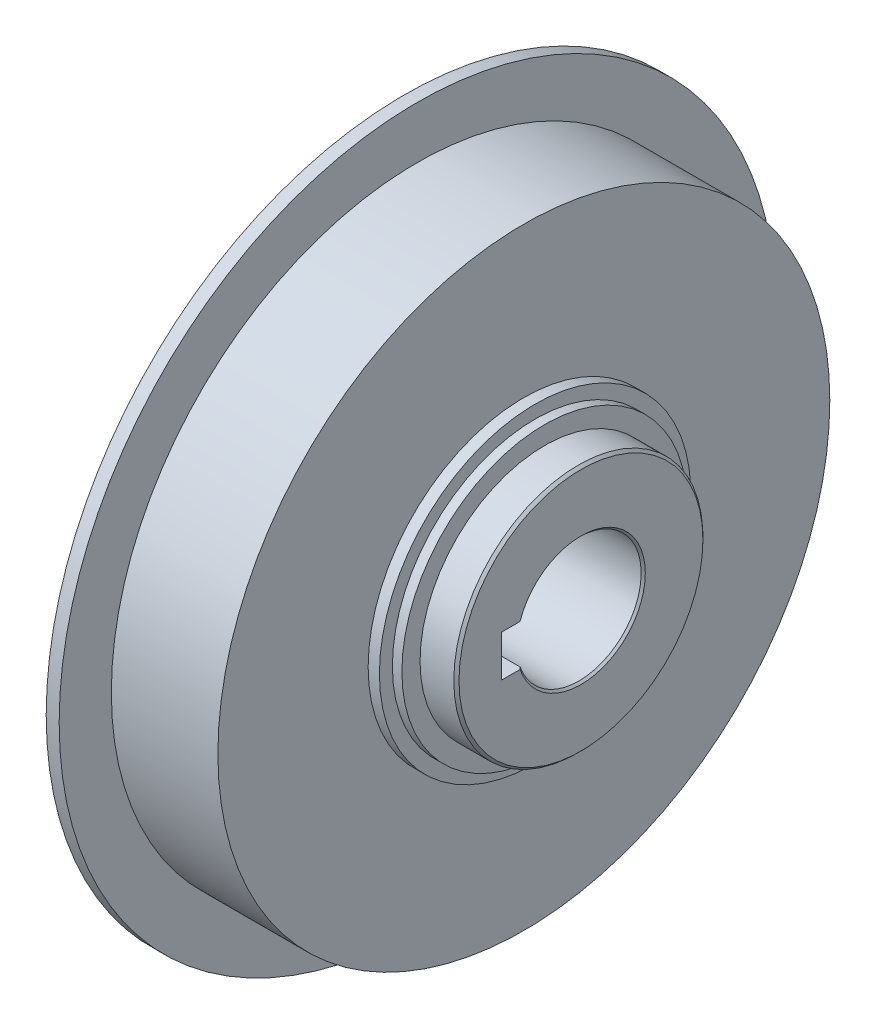
ISO-10303-21;
HEADER;
FILE_DESCRIPTION(('STEP AP214'),'2;1');
FILE_NAME('part.step','',(''),(''),'','','');
FILE_SCHEMA(('AUTOMOTIVE_DESIGN { 1 0 10303 214 1 1 1 1 }'));
ENDSEC;
DATA;
#1=APPLICATION_CONTEXT('core data for automotive mechanical design processes');
#2=APPLICATION_PROTOCOL_DEFINITION('international standard','automotive_design',2000,#1);
#3=PRODUCT_CONTEXT('',#1,'mechanical');
#4=PRODUCT('Part','Part','',(#3));
#5=PRODUCT_RELATED_PRODUCT_CATEGORY('part','',(#4));
#6=PRODUCT_DEFINITION_FORMATION('','',#4);
#7=PRODUCT_DEFINITION_CONTEXT('part definition',#1,'design');
#8=PRODUCT_DEFINITION('design','',#6,#7);
#9=PRODUCT_DEFINITION_SHAPE('','',#8);
#10=(LENGTH_UNIT() NAMED_UNIT(*) SI_UNIT(.MILLI.,.METRE.));
#11=(NAMED_UNIT(*) PLANE_ANGLE_UNIT() SI_UNIT($,.RADIAN.));
#12=(NAMED_UNIT(*) SI_UNIT($,.STERADIAN.) SOLID_ANGLE_UNIT());
#13=UNCERTAINTY_MEASURE_WITH_UNIT(LENGTH_MEASURE(1.E-05),#10,'distance_accuracy_value','');
#14=(GEOMETRIC_REPRESENTATION_CONTEXT(3) GLOBAL_UNCERTAINTY_ASSIGNED_CONTEXT((#13)) GLOBAL_UNIT_ASSIGNED_CONTEXT((#10,
#11,#12)) REPRESENTATION_CONTEXT('',''));
#15=CARTESIAN_POINT('',(0.,0.,0.));
#16=DIRECTION('',(0.,0.,1.));
#17=DIRECTION('',(1.,0.,0.));
#18=AXIS2_PLACEMENT_3D('',#15,#16,#17);
#19=CARTESIAN_POINT('',(83.1,0.,0.));
#20=DIRECTION('',(1.,0.,0.));
#21=DIRECTION('',(0.,0.,-1.00000000000001));
#22=AXIS2_PLACEMENT_3D('',#19,#20,#21);
#23=CONICAL_SURFACE('',#22,12.4,0.78539816339744);
#24=CARTESIAN_POINT('',(82.7,0.,0.));
#25=DIRECTION('',(-1.,0.,0.));
#26=DIRECTION('',(0.,0.,1.00000000000001));
#27=AXIS2_PLACEMENT_3D('',#24,#25,#26);
#28=CIRCLE('',#27,12.);
#29=CARTESIAN_POINT('',(82.7,4.,11.3137084989848));
#30=VERTEX_POINT('',#29);
#31=CARTESIAN_POINT('',(82.7,-4.,11.3137084989848));
#32=VERTEX_POINT('',#31);
#33=EDGE_CURVE('E87',#30,#32,#28,.T.);
#34=ORIENTED_EDGE('',*,*,#33,.T.);
#35=CARTESIAN_POINT('',(83.1,-4.,11.7371206008971));
#36=CARTESIAN_POINT('',(83.0332637530497,-4.,11.6666176506963));
#37=CARTESIAN_POINT('',(82.9665622963739,-4.,11.5960818339106));
#38=CARTESIAN_POINT('',(82.83322896304,-4.,11.454944466607));
#39=CARTESIAN_POINT('',(82.7665970863825,-4.,11.3843429160886));
#40=CARTESIAN_POINT('',(82.7,-4.,11.3137084989848));
#41=B_SPLINE_CURVE_WITH_KNOTS('',3,(#35,#36,#37,#38,#39,#40),.UNSPECIFIED.,.F.,.F.,(4,2,4),(0.,
0.291237827128785,0.582475656578423),.UNSPECIFIED.);
#42=CARTESIAN_POINT('',(83.1,-4.,11.737120600897));
#43=VERTEX_POINT('',#42);
#44=EDGE_CURVE('E82',#43,#32,#41,.T.);
#45=ORIENTED_EDGE('',*,*,#44,.F.);
#46=CARTESIAN_POINT('',(83.1,0.,0.));
#47=DIRECTION('',(1.,0.,0.));
#48=DIRECTION('',(0.,0.,-1.00000000000001));
#49=AXIS2_PLACEMENT_3D('',#46,#47,#48);
#50=CIRCLE('',#49,12.4);
#51=CARTESIAN_POINT('',(83.1,4.,11.7371206008971));
#52=VERTEX_POINT('',#51);
#53=EDGE_CURVE('E80',#52,#43,#50,.F.);
#54=ORIENTED_EDGE('',*,*,#53,.F.);
#55=CARTESIAN_POINT('',(82.7,4.,11.3137084989848));
#56=CARTESIAN_POINT('',(82.7665970863825,4.,11.3843429160886));
#57=CARTESIAN_POINT('',(82.83322896304,4.,11.454944466607));
#58=CARTESIAN_POINT('',(82.9665622963739,4.,11.5960818339106));
#59=CARTESIAN_POINT('',(83.0332637530497,4.,11.6666176506963));
#60=CARTESIAN_POINT('',(83.1,4.,11.7371206008971));
#61=B_SPLINE_CURVE_WITH_KNOTS('',3,(#55,#56,#57,#58,#59,#60),.UNSPECIFIED.,.F.,.F.,(4,2,4),(0.,
0.291237829449643,0.58247565657843),.UNSPECIFIED.);
#62=EDGE_CURVE('E28',#30,#52,#61,.T.);
#63=ORIENTED_EDGE('',*,*,#62,.F.);
#64=EDGE_LOOP('',(#34,#45,#54,#63));
#65=FACE_BOUND('',#64,.T.);
#66=ADVANCED_FACE('F24',(#65),#23,.F.);
#67=CARTESIAN_POINT('',(60.8,0.,0.));
#68=DIRECTION('',(-1.,0.,0.));
#69=DIRECTION('',(0.,0.,1.00000000000001));
#70=AXIS2_PLACEMENT_3D('',#67,#68,#69);
#71=CYLINDRICAL_SURFACE('',#70,12.);
#72=ORIENTED_EDGE('',*,*,#33,.F.);
#73=DIRECTION('',(1.,0.,0.));
#74=VECTOR('',#73,1.);
#75=CARTESIAN_POINT('',(60.8,4.,11.3137084989848));
#76=LINE('',#75,#74);
#77=CARTESIAN_POINT('',(38.9,4.,11.3137084989848));
#78=VERTEX_POINT('',#77);
#79=EDGE_CURVE('E95',#78,#30,#76,.T.);
#80=ORIENTED_EDGE('',*,*,#79,.F.);
#81=CARTESIAN_POINT('',(38.9,0.,0.));
#82=DIRECTION('',(-1.,0.,0.));
#83=DIRECTION('',(0.,0.,1.00000000000001));
#84=AXIS2_PLACEMENT_3D('',#81,#82,#83);
#85=CIRCLE('',#84,12.);
#86=CARTESIAN_POINT('',(38.9,-4.,11.3137084989848));
#87=VERTEX_POINT('',#86);
#88=EDGE_CURVE('E101',#78,#87,#85,.T.);
#89=ORIENTED_EDGE('',*,*,#88,.T.);
#90=DIRECTION('',(1.,0.,0.));
#91=VECTOR('',#90,1.);
#92=CARTESIAN_POINT('',(60.8,-4.,11.3137084989848));
#93=LINE('',#92,#91);
#94=EDGE_CURVE('E86',#32,#87,#93,.F.);
#95=ORIENTED_EDGE('',*,*,#94,.F.);
#96=EDGE_LOOP('',(#72,#80,#89,#95));
#97=FACE_BOUND('',#96,.T.);
#98=ADVANCED_FACE('F315',(#97),#71,.F.);
#99=CARTESIAN_POINT('',(83.1,0.,17.9500000000001));
#100=DIRECTION('',(1.,0.,0.));
#101=DIRECTION('',(0.,0.,-1.00000000000001));
#102=AXIS2_PLACEMENT_3D('',#99,#100,#101);
#103=PLANE('',#102);
#104=DIRECTION('',(0.,0.,-1.00000000000001));
#105=VECTOR('',#104,1.);
#106=CARTESIAN_POINT('',(83.1,4.,7.65000000000005));
#107=LINE('',#106,#105);
#108=CARTESIAN_POINT('',(83.1,4.,15.3000000000001));
#109=VERTEX_POINT('',#108);
#110=EDGE_CURVE('E92',#52,#109,#107,.F.);
#111=ORIENTED_EDGE('',*,*,#110,.F.);
#112=ORIENTED_EDGE('',*,*,#53,.T.);
#113=DIRECTION('',(0.,0.,1.00000000000001));
#114=VECTOR('',#113,1.);
#115=CARTESIAN_POINT('',(83.1,-4.,7.65000000000005));
#116=LINE('',#115,#114);
#117=CARTESIAN_POINT('',(83.1,-4.,15.3000000000001));
#118=VERTEX_POINT('',#117);
#119=EDGE_CURVE('E117',#118,#43,#116,.F.);
#120=ORIENTED_EDGE('',*,*,#119,.F.);
#121=DIRECTION('',(0.,1.00000000000001,0.));
#122=VECTOR('',#121,1.);
#123=CARTESIAN_POINT('',(83.1,0.,15.3000000000001));
#124=LINE('',#123,#122);
#125=EDGE_CURVE('E99',#118,#109,#124,.T.);
#126=ORIENTED_EDGE('',*,*,#125,.T.);
#127=EDGE_LOOP('',(#111,#112,#120,#126));
#128=FACE_BOUND('',#127,.T.);
#129=CARTESIAN_POINT('',(83.1,0.,0.));
#130=DIRECTION('',(-1.,0.,0.));
#131=DIRECTION('',(0.,0.,1.00000000000001));
#132=AXIS2_PLACEMENT_3D('',#129,#130,#131);
#133=CIRCLE('',#132,23.5);
#134=CARTESIAN_POINT('',(83.1,0.,23.5000000000001));
#135=VERTEX_POINT('',#134);
#136=EDGE_CURVE('E156',#135,#135,#133,.T.);
#137=ORIENTED_EDGE('',*,*,#136,.F.);
#138=EDGE_LOOP('',(#137));
#139=FACE_BOUND('',#138,.T.);
#140=ADVANCED_FACE('F96',(#128,#139),#103,.T.);
#141=CARTESIAN_POINT('',(60.8,-4.,7.65000000000005));
#142=DIRECTION('',(0.,1.00000000000001,0.));
#143=DIRECTION('',(0.,0.,1.00000000000001));
#144=AXIS2_PLACEMENT_3D('',#141,#142,#143);
#145=PLANE('',#144);
#146=DIRECTION('',(1.,0.,0.));
#147=VECTOR('',#146,1.);
#148=CARTESIAN_POINT('',(60.8,-4.,15.3000000000001));
#149=LINE('',#148,#147);
#150=CARTESIAN_POINT('',(38.5,-4.,15.3000000000001));
#151=VERTEX_POINT('',#150);
#152=EDGE_CURVE('E348',#151,#118,#149,.T.);
#153=ORIENTED_EDGE('',*,*,#152,.T.);
#154=ORIENTED_EDGE('',*,*,#119,.T.);
#155=ORIENTED_EDGE('',*,*,#44,.T.);
#156=ORIENTED_EDGE('',*,*,#94,.T.);
#157=CARTESIAN_POINT('',(38.9,-4.,11.3137084989848));
#158=CARTESIAN_POINT('',(38.8334029136175,-4.,11.3843429160886));
#159=CARTESIAN_POINT('',(38.76677103696,-4.,11.454944466607));
#160=CARTESIAN_POINT('',(38.6334377036261,-4.,11.5960818339106));
#161=CARTESIAN_POINT('',(38.5667362469503,-4.,11.6666176506963));
#162=CARTESIAN_POINT('',(38.5,-4.,11.7371206008971));
#163=B_SPLINE_CURVE_WITH_KNOTS('',3,(#157,#158,#159,#160,#161,#162),.UNSPECIFIED.,.F.,.F.,(4,2,
4),(0.,0.291237829449646,0.582475656578446),.UNSPECIFIED.);
#164=CARTESIAN_POINT('',(38.5,-4.,11.7371206008971));
#165=VERTEX_POINT('',#164);
#166=EDGE_CURVE('E104',#87,#165,#163,.T.);
#167=ORIENTED_EDGE('',*,*,#166,.T.);
#168=DIRECTION('',(0.,0.,1.00000000000001));
#169=VECTOR('',#168,1.);
#170=CARTESIAN_POINT('',(38.5,-4.,32.2625000000002));
#171=LINE('',#170,#169);
#172=EDGE_CURVE('E155',#151,#165,#171,.F.);
#173=ORIENTED_EDGE('',*,*,#172,.F.);
#174=EDGE_LOOP('',(#153,#154,#155,#156,#167,#173));
#175=FACE_BOUND('',#174,.T.);
#176=ADVANCED_FACE('F302',(#175),#145,.T.);
#177=CARTESIAN_POINT('',(38.5,0.,0.));
#178=DIRECTION('',(-1.,0.,0.));
#179=DIRECTION('',(0.,0.,1.00000000000001));
#180=AXIS2_PLACEMENT_3D('',#177,#178,#179);
#181=CONICAL_SURFACE('',#180,12.4,0.78539816339745);
#182=ORIENTED_EDGE('',*,*,#88,.F.);
#183=CARTESIAN_POINT('',(38.5,4.,11.7371206008971));
#184=CARTESIAN_POINT('',(38.5667362469503,4.,11.6666176506963));
#185=CARTESIAN_POINT('',(38.6334377036261,4.,11.5960818339106));
#186=CARTESIAN_POINT('',(38.76677103696,4.,11.454944466607));
#187=CARTESIAN_POINT('',(38.8334029136175,4.,11.3843429160886));
#188=CARTESIAN_POINT('',(38.9,4.,11.3137084989848));
#189=B_SPLINE_CURVE_WITH_KNOTS('',3,(#183,#184,#185,#186,#187,#188),.UNSPECIFIED.,.F.,.F.,(4,2,
4),(0.,0.291237827128781,0.582475656578414),.UNSPECIFIED.);
#190=CARTESIAN_POINT('',(38.5,4.,11.7371206008971));
#191=VERTEX_POINT('',#190);
#192=EDGE_CURVE('E100',#191,#78,#189,.T.);
#193=ORIENTED_EDGE('',*,*,#192,.F.);
#194=CARTESIAN_POINT('',(38.5,0.,0.));
#195=DIRECTION('',(-1.,0.,0.));
#196=DIRECTION('',(0.,0.,1.00000000000001));
#197=AXIS2_PLACEMENT_3D('',#194,#195,#196);
#198=CIRCLE('',#197,12.4);
#199=EDGE_CURVE('E151',#165,#191,#198,.F.);
#200=ORIENTED_EDGE('',*,*,#199,.F.);
#201=ORIENTED_EDGE('',*,*,#166,.F.);
#202=EDGE_LOOP('',(#182,#193,#200,#201));
#203=FACE_BOUND('',#202,.T.);
#204=ADVANCED_FACE('F167',(#203),#181,.F.);
#205=CARTESIAN_POINT('',(60.8,4.,7.65000000000005));
#206=DIRECTION('',(0.,-1.00000000000001,0.));
#207=DIRECTION('',(0.,0.,-1.00000000000001));
#208=AXIS2_PLACEMENT_3D('',#205,#206,#207);
#209=PLANE('',#208);
#210=ORIENTED_EDGE('',*,*,#192,.T.);
#211=ORIENTED_EDGE('',*,*,#79,.T.);
#212=ORIENTED_EDGE('',*,*,#62,.T.);
#213=ORIENTED_EDGE('',*,*,#110,.T.);
#214=DIRECTION('',(1.,0.,0.));
#215=VECTOR('',#214,1.);
#216=CARTESIAN_POINT('',(60.8,4.,15.3000000000001));
#217=LINE('',#216,#215);
#218=CARTESIAN_POINT('',(38.5,4.,15.3000000000001));
#219=VERTEX_POINT('',#218);
#220=EDGE_CURVE('E47',#109,#219,#217,.F.);
#221=ORIENTED_EDGE('',*,*,#220,.T.);
#222=DIRECTION('',(0.,0.,1.00000000000001));
#223=VECTOR('',#222,1.);
#224=CARTESIAN_POINT('',(38.5,4.,32.2625000000002));
#225=LINE('',#224,#223);
#226=EDGE_CURVE('E154',#191,#219,#225,.T.);
#227=ORIENTED_EDGE('',*,*,#226,.F.);
#228=EDGE_LOOP('',(#210,#211,#212,#213,#221,#227));
#229=FACE_BOUND('',#228,.T.);
#230=ADVANCED_FACE('F91',(#229),#209,.T.);
#231=CARTESIAN_POINT('',(60.8,0.,15.3000000000001));
#232=DIRECTION('',(0.,0.,1.00000000000001));
#233=DIRECTION('',(1.,0.,0.));
#234=AXIS2_PLACEMENT_3D('',#231,#232,#233);
#235=PLANE('',#234);
#236=ORIENTED_EDGE('',*,*,#152,.F.);
#237=DIRECTION('',(0.,1.00000000000001,0.));
#238=VECTOR('',#237,1.);
#239=CARTESIAN_POINT('',(38.5,0.,15.3000000000001));
#240=LINE('',#239,#238);
#241=EDGE_CURVE('E356',#219,#151,#240,.F.);
#242=ORIENTED_EDGE('',*,*,#241,.F.);
#243=ORIENTED_EDGE('',*,*,#220,.F.);
#244=ORIENTED_EDGE('',*,*,#125,.F.);
#245=EDGE_LOOP('',(#236,#242,#243,#244));
#246=FACE_BOUND('',#245,.T.);
#247=ADVANCED_FACE('F172',(#246),#235,.F.);
#248=CARTESIAN_POINT('',(82.6,0.,0.));
#249=DIRECTION('',(-1.,0.,0.));
#250=DIRECTION('',(0.,0.,1.00000000000001));
#251=AXIS2_PLACEMENT_3D('',#248,#249,#250);
#252=CONICAL_SURFACE('',#251,24.,0.785398163397448);
#253=ORIENTED_EDGE('',*,*,#136,.T.);
#254=EDGE_LOOP('',(#253));
#255=FACE_BOUND('',#254,.T.);
#256=CARTESIAN_POINT('',(82.6,0.,0.));
#257=DIRECTION('',(-1.,0.,0.));
#258=DIRECTION('',(0.,0.,1.00000000000001));
#259=AXIS2_PLACEMENT_3D('',#256,#257,#258);
#260=CIRCLE('',#259,24.);
#261=CARTESIAN_POINT('',(82.6,0.,24.0000000000001));
#262=VERTEX_POINT('',#261);
#263=EDGE_CURVE('E150',#262,#262,#260,.T.);
#264=ORIENTED_EDGE('',*,*,#263,.F.);
#265=EDGE_LOOP('',(#264));
#266=FACE_BOUND('',#265,.T.);
#267=ADVANCED_FACE('F176',(#255,#266),#252,.T.);
#268=CARTESIAN_POINT('',(38.5,0.,32.2625000000002));
#269=DIRECTION('',(-1.,0.,0.));
#270=DIRECTION('',(0.,0.,1.00000000000001));
#271=AXIS2_PLACEMENT_3D('',#268,#269,#270);
#272=PLANE('',#271);
#273=CARTESIAN_POINT('',(38.5,0.,0.));
#274=DIRECTION('',(-1.,0.,0.));
#275=DIRECTION('',(0.,0.,1.00000000000001));
#276=AXIS2_PLACEMENT_3D('',#273,#274,#275);
#277=CIRCLE('',#276,52.125);
#278=CARTESIAN_POINT('',(38.5,0.,52.1250000000003));
#279=VERTEX_POINT('',#278);
#280=EDGE_CURVE('E147',#279,#279,#277,.F.);
#281=ORIENTED_EDGE('',*,*,#280,.F.);
#282=EDGE_LOOP('',(#281));
#283=FACE_BOUND('',#282,.T.);
#284=ORIENTED_EDGE('',*,*,#226,.T.);
#285=ORIENTED_EDGE('',*,*,#241,.T.);
#286=ORIENTED_EDGE('',*,*,#172,.T.);
#287=ORIENTED_EDGE('',*,*,#199,.T.);
#288=EDGE_LOOP('',(#284,#285,#286,#287));
#289=FACE_BOUND('',#288,.T.);
#290=ADVANCED_FACE('F180',(#283,#289),#272,.T.);
#291=CARTESIAN_POINT('',(79.35,0.,0.));
#292=DIRECTION('',(-1.,0.,0.));
#293=DIRECTION('',(0.,0.,1.00000000000001));
#294=AXIS2_PLACEMENT_3D('',#291,#292,#293);
#295=CYLINDRICAL_SURFACE('',#294,24.);
#296=ORIENTED_EDGE('',*,*,#263,.T.);
#297=EDGE_LOOP('',(#296));
#298=FACE_BOUND('',#297,.T.);
#299=CARTESIAN_POINT('',(76.1,0.,0.));
#300=DIRECTION('',(-1.,0.,0.));
#301=DIRECTION('',(0.,0.,1.00000000000001));
#302=AXIS2_PLACEMENT_3D('',#299,#300,#301);
#303=CIRCLE('',#302,24.);
#304=CARTESIAN_POINT('',(76.1,0.,24.0000000000001));
#305=VERTEX_POINT('',#304);
#306=EDGE_CURVE('E144',#305,#305,#303,.T.);
#307=ORIENTED_EDGE('',*,*,#306,.F.);
#308=EDGE_LOOP('',(#307));
#309=FACE_BOUND('',#308,.T.);
#310=ADVANCED_FACE('F184',(#298,#309),#295,.T.);
#311=CARTESIAN_POINT('',(43.785,0.,0.));
#312=DIRECTION('',(-1.,0.,0.));
#313=DIRECTION('',(0.,0.,1.00000000000001));
#314=AXIS2_PLACEMENT_3D('',#311,#312,#313);
#315=CYLINDRICAL_SURFACE('',#314,52.125);
#316=CARTESIAN_POINT('',(49.07,0.,0.));
#317=DIRECTION('',(-1.,0.,0.));
#318=DIRECTION('',(0.,0.,1.00000000000001));
#319=AXIS2_PLACEMENT_3D('',#316,#317,#318);
#320=CIRCLE('',#319,52.125);
#321=CARTESIAN_POINT('',(49.07,0.,52.1250000000003));
#322=VERTEX_POINT('',#321);
#323=EDGE_CURVE('E141',#322,#322,#320,.F.);
#324=ORIENTED_EDGE('',*,*,#323,.F.);
#325=EDGE_LOOP('',(#324));
#326=FACE_BOUND('',#325,.T.);
#327=ORIENTED_EDGE('',*,*,#280,.T.);
#328=EDGE_LOOP('',(#327));
#329=FACE_BOUND('',#328,.T.);
#330=ADVANCED_FACE('F188',(#326,#329),#315,.T.);
#331=CARTESIAN_POINT('',(76.1,0.,25.7500000000002));
#332=DIRECTION('',(1.,0.,0.));
#333=DIRECTION('',(0.,0.,-1.00000000000001));
#334=AXIS2_PLACEMENT_3D('',#331,#332,#333);
#335=PLANE('',#334);
#336=CARTESIAN_POINT('',(76.1,0.,0.));
#337=DIRECTION('',(-1.,0.,0.));
#338=DIRECTION('',(0.,0.,1.00000000000001));
#339=AXIS2_PLACEMENT_3D('',#336,#337,#338);
#340=CIRCLE('',#339,27.5);
#341=CARTESIAN_POINT('',(76.1,0.,27.5000000000002));
#342=VERTEX_POINT('',#341);
#343=EDGE_CURVE('E138',#342,#342,#340,.T.);
#344=ORIENTED_EDGE('',*,*,#343,.F.);
#345=EDGE_LOOP('',(#344));
#346=FACE_BOUND('',#345,.T.);
#347=ORIENTED_EDGE('',*,*,#306,.T.);
#348=EDGE_LOOP('',(#347));
#349=FACE_BOUND('',#348,.T.);
#350=ADVANCED_FACE('F192',(#346,#349),#335,.T.);
#351=CARTESIAN_POINT('',(49.07,0.,60.5625000000004));
#352=DIRECTION('',(-1.,0.,0.));
#353=DIRECTION('',(0.,0.,1.00000000000001));
#354=AXIS2_PLACEMENT_3D('',#351,#352,#353);
#355=PLANE('',#354);
#356=ORIENTED_EDGE('',*,*,#323,.T.);
#357=EDGE_LOOP('',(#356));
#358=FACE_BOUND('',#357,.T.);
#359=CARTESIAN_POINT('',(49.07,0.,0.));
#360=DIRECTION('',(-1.,0.,0.));
#361=DIRECTION('',(0.,0.,1.00000000000001));
#362=AXIS2_PLACEMENT_3D('',#359,#360,#361);
#363=CIRCLE('',#362,69.);
#364=CARTESIAN_POINT('',(49.07,0.,69.0000000000004));
#365=VERTEX_POINT('',#364);
#366=EDGE_CURVE('E135',#365,#365,#363,.F.);
#367=ORIENTED_EDGE('',*,*,#366,.F.);
#368=EDGE_LOOP('',(#367));
#369=FACE_BOUND('',#368,.T.);
#370=ADVANCED_FACE('F196',(#358,#369),#355,.T.);
#371=CARTESIAN_POINT('',(75.185,0.,0.));
#372=DIRECTION('',(-1.,0.,0.));
#373=DIRECTION('',(0.,0.,1.00000000000001));
#374=AXIS2_PLACEMENT_3D('',#371,#372,#373);
#375=CYLINDRICAL_SURFACE('',#374,27.5);
#376=ORIENTED_EDGE('',*,*,#343,.T.);
#377=EDGE_LOOP('',(#376));
#378=FACE_BOUND('',#377,.T.);
#379=CARTESIAN_POINT('',(74.27,0.,0.));
#380=DIRECTION('',(-1.,0.,0.));
#381=DIRECTION('',(0.,0.,1.00000000000001));
#382=AXIS2_PLACEMENT_3D('',#379,#380,#381);
#383=CIRCLE('',#382,27.5);
#384=CARTESIAN_POINT('',(74.27,0.,27.5000000000002));
#385=VERTEX_POINT('',#384);
#386=EDGE_CURVE('E132',#385,#385,#383,.T.);
#387=ORIENTED_EDGE('',*,*,#386,.F.);
#388=EDGE_LOOP('',(#387));
#389=FACE_BOUND('',#388,.T.);
#390=ADVANCED_FACE('F200',(#378,#389),#375,.T.);
#391=CARTESIAN_POINT('',(50.32,0.,0.));
#392=DIRECTION('',(-1.,0.,0.));
#393=DIRECTION('',(0.,0.,1.00000000000001));
#394=AXIS2_PLACEMENT_3D('',#391,#392,#393);
#395=CYLINDRICAL_SURFACE('',#394,69.);
#396=CARTESIAN_POINT('',(51.57,0.,0.));
#397=DIRECTION('',(-1.,0.,0.));
#398=DIRECTION('',(0.,0.,1.00000000000001));
#399=AXIS2_PLACEMENT_3D('',#396,#397,#398);
#400=CIRCLE('',#399,69.);
#401=CARTESIAN_POINT('',(51.57,0.,69.0000000000004));
#402=VERTEX_POINT('',#401);
#403=EDGE_CURVE('E129',#402,#402,#400,.F.);
#404=ORIENTED_EDGE('',*,*,#403,.F.);
#405=EDGE_LOOP('',(#404));
#406=FACE_BOUND('',#405,.T.);
#407=ORIENTED_EDGE('',*,*,#366,.T.);
#408=EDGE_LOOP('',(#407));
#409=FACE_BOUND('',#408,.T.);
#410=ADVANCED_FACE('F204',(#406,#409),#395,.T.);
#411=CARTESIAN_POINT('',(74.27,0.,28.7500000000002));
#412=DIRECTION('',(1.,0.,0.));
#413=DIRECTION('',(0.,0.,-1.00000000000001));
#414=AXIS2_PLACEMENT_3D('',#411,#412,#413);
#415=PLANE('',#414);
#416=CARTESIAN_POINT('',(74.27,0.,0.));
#417=DIRECTION('',(-1.,0.,0.));
#418=DIRECTION('',(0.,0.,1.00000000000001));
#419=AXIS2_PLACEMENT_3D('',#416,#417,#418);
#420=CIRCLE('',#419,30.);
#421=CARTESIAN_POINT('',(74.27,0.,30.0000000000002));
#422=VERTEX_POINT('',#421);
#423=EDGE_CURVE('E126',#422,#422,#420,.T.);
#424=ORIENTED_EDGE('',*,*,#423,.F.);
#425=EDGE_LOOP('',(#424));
#426=FACE_BOUND('',#425,.T.);
#427=ORIENTED_EDGE('',*,*,#386,.T.);
#428=EDGE_LOOP('',(#427));
#429=FACE_BOUND('',#428,.T.);
#430=ADVANCED_FACE('F208',(#426,#429),#415,.T.);
#431=CARTESIAN_POINT('',(51.57,0.,63.9750000000004));
#432=DIRECTION('',(1.,0.,0.));
#433=DIRECTION('',(0.,0.,-1.00000000000001));
#434=AXIS2_PLACEMENT_3D('',#431,#432,#433);
#435=PLANE('',#434);
#436=ORIENTED_EDGE('',*,*,#403,.T.);
#437=EDGE_LOOP('',(#436));
#438=FACE_BOUND('',#437,.T.);
#439=CARTESIAN_POINT('',(51.57,0.,0.));
#440=DIRECTION('',(-1.,0.,0.));
#441=DIRECTION('',(0.,0.,1.00000000000001));
#442=AXIS2_PLACEMENT_3D('',#439,#440,#441);
#443=CIRCLE('',#442,58.95);
#444=CARTESIAN_POINT('',(51.57,0.,58.9500000000004));
#445=VERTEX_POINT('',#444);
#446=EDGE_CURVE('E123',#445,#445,#443,.F.);
#447=ORIENTED_EDGE('',*,*,#446,.F.);
#448=EDGE_LOOP('',(#447));
#449=FACE_BOUND('',#448,.T.);
#450=ADVANCED_FACE('F212',(#438,#449),#435,.T.);
#451=CARTESIAN_POINT('',(73.185,0.,0.));
#452=DIRECTION('',(-1.,0.,0.));
#453=DIRECTION('',(0.,0.,1.00000000000001));
#454=AXIS2_PLACEMENT_3D('',#451,#452,#453);
#455=CYLINDRICAL_SURFACE('',#454,30.);
#456=ORIENTED_EDGE('',*,*,#423,.T.);
#457=EDGE_LOOP('',(#456));
#458=FACE_BOUND('',#457,.T.);
#459=CARTESIAN_POINT('',(72.1,0.,0.));
#460=DIRECTION('',(-1.,0.,0.));
#461=DIRECTION('',(0.,0.,1.00000000000001));
#462=AXIS2_PLACEMENT_3D('',#459,#460,#461);
#463=CIRCLE('',#462,30.);
#464=CARTESIAN_POINT('',(72.1,0.,30.0000000000002));
#465=VERTEX_POINT('',#464);
#466=EDGE_CURVE('E38',#465,#465,#463,.T.);
#467=ORIENTED_EDGE('',*,*,#466,.F.);
#468=EDGE_LOOP('',(#467));
#469=FACE_BOUND('',#468,.T.);
#470=ADVANCED_FACE('F216',(#458,#469),#455,.T.);
#471=CARTESIAN_POINT('',(61.835,0.,0.));
#472=DIRECTION('',(-1.,0.,0.));
#473=DIRECTION('',(0.,0.,1.00000000000001));
#474=AXIS2_PLACEMENT_3D('',#471,#472,#473);
#475=CYLINDRICAL_SURFACE('',#474,58.95);
#476=CARTESIAN_POINT('',(72.1,0.,0.));
#477=DIRECTION('',(-1.,0.,0.));
#478=DIRECTION('',(0.,0.,1.00000000000001));
#479=AXIS2_PLACEMENT_3D('',#476,#477,#478);
#480=CIRCLE('',#479,58.95);
#481=CARTESIAN_POINT('',(72.1,0.,58.9500000000004));
#482=VERTEX_POINT('',#481);
#483=EDGE_CURVE('E13',#482,#482,#480,.F.);
#484=ORIENTED_EDGE('',*,*,#483,.F.);
#485=EDGE_LOOP('',(#484));
#486=FACE_BOUND('',#485,.T.);
#487=ORIENTED_EDGE('',*,*,#446,.T.);
#488=EDGE_LOOP('',(#487));
#489=FACE_BOUND('',#488,.T.);
#490=ADVANCED_FACE('F220',(#486,#489),#475,.T.);
#491=CARTESIAN_POINT('',(72.1,0.,44.4750000000002));
#492=DIRECTION('',(1.,0.,0.));
#493=DIRECTION('',(0.,0.,-1.00000000000001));
#494=AXIS2_PLACEMENT_3D('',#491,#492,#493);
#495=PLANE('',#494);
#496=ORIENTED_EDGE('',*,*,#483,.T.);
#497=EDGE_LOOP('',(#496));
#498=FACE_BOUND('',#497,.T.);
#499=ORIENTED_EDGE('',*,*,#466,.T.);
#500=EDGE_LOOP('',(#499));
#501=FACE_BOUND('',#500,.T.);
#502=ADVANCED_FACE('F224',(#498,#501),#495,.T.);
#503=CLOSED_SHELL('',(#66,#98,#140,#176,#204,#230,#247,#267,#290,#310,#330,#350,#370,#390,#410,
#430,#450,#470,#490,#502));
#504=MANIFOLD_SOLID_BREP('B1',#503);
#505=ADVANCED_BREP_SHAPE_REPRESENTATION('',(#18,#504),#14);
#506=SHAPE_DEFINITION_REPRESENTATION(#9,#505);
ENDSEC;
END-ISO-10303-21;
